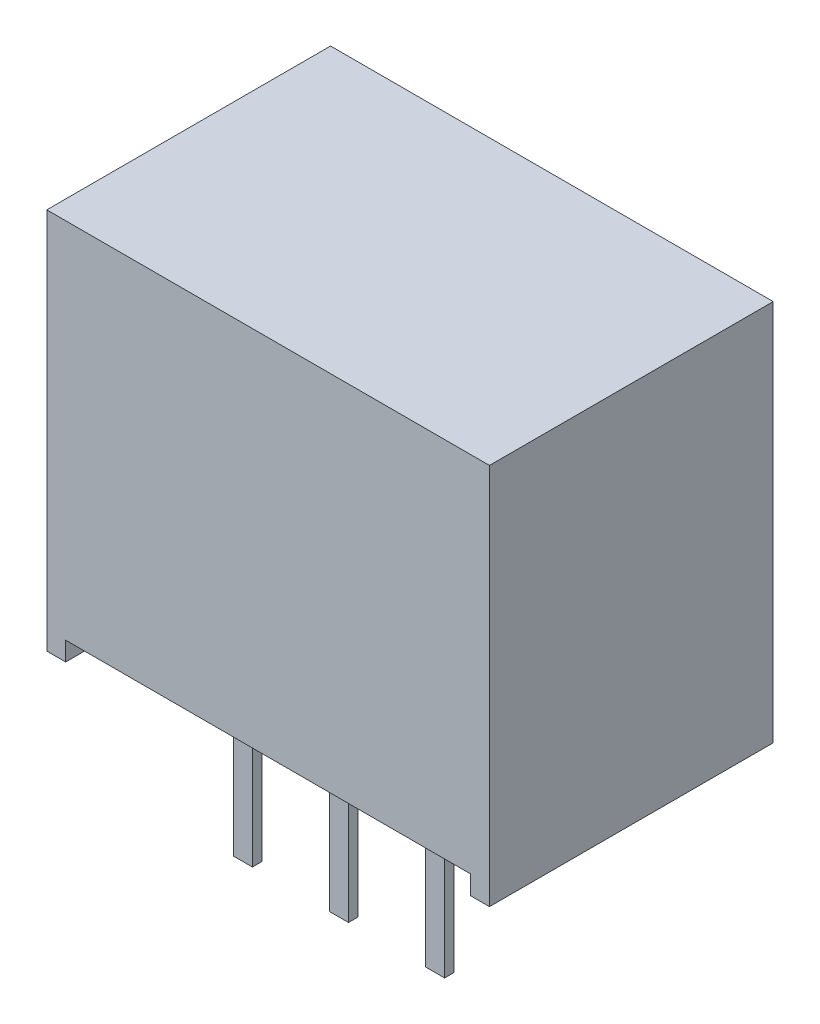
ISO-10303-21;
HEADER;
FILE_DESCRIPTION(('STEP AP214'),'2;1');
FILE_NAME('part.step','',(''),(''),'','','');
FILE_SCHEMA(('AUTOMOTIVE_DESIGN { 1 0 10303 214 1 1 1 1 }'));
ENDSEC;
DATA;
#1=APPLICATION_CONTEXT('core data for automotive mechanical design processes');
#2=APPLICATION_PROTOCOL_DEFINITION('international standard','automotive_design',2000,#1);
#3=PRODUCT_CONTEXT('',#1,'mechanical');
#4=PRODUCT('Part','Part','',(#3));
#5=PRODUCT_RELATED_PRODUCT_CATEGORY('part','',(#4));
#6=PRODUCT_DEFINITION_FORMATION('','',#4);
#7=PRODUCT_DEFINITION_CONTEXT('part definition',#1,'design');
#8=PRODUCT_DEFINITION('design','',#6,#7);
#9=PRODUCT_DEFINITION_SHAPE('','',#8);
#10=(LENGTH_UNIT() NAMED_UNIT(*) SI_UNIT(.MILLI.,.METRE.));
#11=(NAMED_UNIT(*) PLANE_ANGLE_UNIT() SI_UNIT($,.RADIAN.));
#12=(NAMED_UNIT(*) SI_UNIT($,.STERADIAN.) SOLID_ANGLE_UNIT());
#13=UNCERTAINTY_MEASURE_WITH_UNIT(LENGTH_MEASURE(1.E-05),#10,'distance_accuracy_value','');
#14=(GEOMETRIC_REPRESENTATION_CONTEXT(3) GLOBAL_UNCERTAINTY_ASSIGNED_CONTEXT((#13)) GLOBAL_UNIT_ASSIGNED_CONTEXT((#10,
#11,#12)) REPRESENTATION_CONTEXT('',''));
#15=CARTESIAN_POINT('',(0.,0.,0.));
#16=DIRECTION('',(0.,0.,1.));
#17=DIRECTION('',(1.,0.,0.));
#18=AXIS2_PLACEMENT_3D('',#15,#16,#17);
#19=CARTESIAN_POINT('',(2.29,-9.4,1.625));
#20=DIRECTION('',(0.,-1.,0.));
#21=DIRECTION('',(0.,0.,-1.));
#22=AXIS2_PLACEMENT_3D('',#19,#20,#21);
#23=PLANE('',#22);
#24=DIRECTION('',(0.,0.,-1.));
#25=VECTOR('',#24,1.);
#26=CARTESIAN_POINT('',(2.29,-9.4,1.875));
#27=LINE('',#26,#25);
#28=CARTESIAN_POINT('',(2.29,-9.4,1.875));
#29=VERTEX_POINT('',#28);
#30=CARTESIAN_POINT('',(2.29,-9.4,1.625));
#31=VERTEX_POINT('',#30);
#32=EDGE_CURVE('E197',#29,#31,#27,.T.);
#33=ORIENTED_EDGE('',*,*,#32,.T.);
#34=DIRECTION('',(1.,0.,0.));
#35=VECTOR('',#34,1.);
#36=CARTESIAN_POINT('',(2.29,-9.4,1.625));
#37=LINE('',#36,#35);
#38=CARTESIAN_POINT('',(2.79,-9.4,1.625));
#39=VERTEX_POINT('',#38);
#40=EDGE_CURVE('E194',#31,#39,#37,.T.);
#41=ORIENTED_EDGE('',*,*,#40,.T.);
#42=DIRECTION('',(0.,0.,1.));
#43=VECTOR('',#42,1.);
#44=CARTESIAN_POINT('',(2.79,-9.4,1.875));
#45=LINE('',#44,#43);
#46=CARTESIAN_POINT('',(2.79,-9.4,1.875));
#47=VERTEX_POINT('',#46);
#48=EDGE_CURVE('E26',#39,#47,#45,.T.);
#49=ORIENTED_EDGE('',*,*,#48,.T.);
#50=DIRECTION('',(-1.,0.,0.));
#51=VECTOR('',#50,1.);
#52=CARTESIAN_POINT('',(2.29,-9.4,1.875));
#53=LINE('',#52,#51);
#54=EDGE_CURVE('E10',#47,#29,#53,.T.);
#55=ORIENTED_EDGE('',*,*,#54,.T.);
#56=EDGE_LOOP('',(#33,#41,#49,#55));
#57=FACE_BOUND('',#56,.T.);
#58=ADVANCED_FACE('F15',(#57),#23,.T.);
#59=CARTESIAN_POINT('',(2.29,-9.4,1.875));
#60=DIRECTION('',(0.,0.,-1.));
#61=DIRECTION('',(0.,-1.,0.));
#62=AXIS2_PLACEMENT_3D('',#59,#60,#61);
#63=PLANE('',#62);
#64=DIRECTION('',(-1.,0.,0.));
#65=VECTOR('',#64,1.);
#66=CARTESIAN_POINT('',(2.29,-4.8,1.875));
#67=LINE('',#66,#65);
#68=CARTESIAN_POINT('',(2.79,-4.8,1.875));
#69=VERTEX_POINT('',#68);
#70=CARTESIAN_POINT('',(2.29,-4.8,1.875));
#71=VERTEX_POINT('',#70);
#72=EDGE_CURVE('E213',#69,#71,#67,.T.);
#73=ORIENTED_EDGE('',*,*,#72,.T.);
#74=DIRECTION('',(0.,1.,0.));
#75=VECTOR('',#74,1.);
#76=CARTESIAN_POINT('',(2.29,-9.4,1.875));
#77=LINE('',#76,#75);
#78=EDGE_CURVE('E178',#29,#71,#77,.T.);
#79=ORIENTED_EDGE('',*,*,#78,.F.);
#80=ORIENTED_EDGE('',*,*,#54,.F.);
#81=DIRECTION('',(0.,1.,0.));
#82=VECTOR('',#81,1.);
#83=CARTESIAN_POINT('',(2.79,-9.4,1.875));
#84=LINE('',#83,#82);
#85=EDGE_CURVE('E290',#47,#69,#84,.T.);
#86=ORIENTED_EDGE('',*,*,#85,.T.);
#87=EDGE_LOOP('',(#73,#79,#80,#86));
#88=FACE_BOUND('',#87,.T.);
#89=ADVANCED_FACE('F707',(#88),#63,.F.);
#90=CARTESIAN_POINT('',(2.79,-9.4,1.875));
#91=DIRECTION('',(-1.,0.,0.));
#92=DIRECTION('',(0.,0.,1.));
#93=AXIS2_PLACEMENT_3D('',#90,#91,#92);
#94=PLANE('',#93);
#95=DIRECTION('',(0.,0.,1.));
#96=VECTOR('',#95,1.);
#97=CARTESIAN_POINT('',(2.79,-4.8,1.875));
#98=LINE('',#97,#96);
#99=CARTESIAN_POINT('',(2.79,-4.8,1.625));
#100=VERTEX_POINT('',#99);
#101=EDGE_CURVE('E207',#100,#69,#98,.T.);
#102=ORIENTED_EDGE('',*,*,#101,.T.);
#103=ORIENTED_EDGE('',*,*,#85,.F.);
#104=ORIENTED_EDGE('',*,*,#48,.F.);
#105=DIRECTION('',(0.,1.,0.));
#106=VECTOR('',#105,1.);
#107=CARTESIAN_POINT('',(2.79,-9.4,1.625));
#108=LINE('',#107,#106);
#109=EDGE_CURVE('E283',#39,#100,#108,.T.);
#110=ORIENTED_EDGE('',*,*,#109,.T.);
#111=EDGE_LOOP('',(#102,#103,#104,#110));
#112=FACE_BOUND('',#111,.T.);
#113=ADVANCED_FACE('F768',(#112),#94,.F.);
#114=CARTESIAN_POINT('',(2.29,-9.4,1.625));
#115=DIRECTION('',(0.,0.,1.));
#116=DIRECTION('',(1.,0.,0.));
#117=AXIS2_PLACEMENT_3D('',#114,#115,#116);
#118=PLANE('',#117);
#119=DIRECTION('',(1.,0.,0.));
#120=VECTOR('',#119,1.);
#121=CARTESIAN_POINT('',(2.29,-4.8,1.625));
#122=LINE('',#121,#120);
#123=CARTESIAN_POINT('',(2.29,-4.8,1.625));
#124=VERTEX_POINT('',#123);
#125=EDGE_CURVE('E191',#124,#100,#122,.T.);
#126=ORIENTED_EDGE('',*,*,#125,.T.);
#127=ORIENTED_EDGE('',*,*,#109,.F.);
#128=ORIENTED_EDGE('',*,*,#40,.F.);
#129=DIRECTION('',(0.,1.,0.));
#130=VECTOR('',#129,1.);
#131=CARTESIAN_POINT('',(2.29,-9.4,1.625));
#132=LINE('',#131,#130);
#133=EDGE_CURVE('E187',#31,#124,#132,.T.);
#134=ORIENTED_EDGE('',*,*,#133,.T.);
#135=EDGE_LOOP('',(#126,#127,#128,#134));
#136=FACE_BOUND('',#135,.T.);
#137=ADVANCED_FACE('F189',(#136),#118,.F.);
#138=CARTESIAN_POINT('',(2.29,-9.4,1.875));
#139=DIRECTION('',(1.,0.,0.));
#140=DIRECTION('',(0.,0.,1.));
#141=AXIS2_PLACEMENT_3D('',#138,#139,#140);
#142=PLANE('',#141);
#143=DIRECTION('',(0.,0.,-1.));
#144=VECTOR('',#143,1.);
#145=CARTESIAN_POINT('',(2.29,-4.8,1.875));
#146=LINE('',#145,#144);
#147=EDGE_CURVE('E205',#71,#124,#146,.T.);
#148=ORIENTED_EDGE('',*,*,#147,.T.);
#149=ORIENTED_EDGE('',*,*,#133,.F.);
#150=ORIENTED_EDGE('',*,*,#32,.F.);
#151=ORIENTED_EDGE('',*,*,#78,.T.);
#152=EDGE_LOOP('',(#148,#149,#150,#151));
#153=FACE_BOUND('',#152,.T.);
#154=ADVANCED_FACE('F211',(#153),#142,.F.);
#155=CARTESIAN_POINT('',(-0.25,-9.4,1.625));
#156=DIRECTION('',(0.,-1.,0.));
#157=DIRECTION('',(0.,0.,-1.));
#158=AXIS2_PLACEMENT_3D('',#155,#156,#157);
#159=PLANE('',#158);
#160=DIRECTION('',(0.,0.,-1.));
#161=VECTOR('',#160,1.);
#162=CARTESIAN_POINT('',(-0.25,-9.4,1.875));
#163=LINE('',#162,#161);
#164=CARTESIAN_POINT('',(-0.25,-9.4,1.875));
#165=VERTEX_POINT('',#164);
#166=CARTESIAN_POINT('',(-0.25,-9.4,1.625));
#167=VERTEX_POINT('',#166);
#168=EDGE_CURVE('E239',#165,#167,#163,.T.);
#169=ORIENTED_EDGE('',*,*,#168,.T.);
#170=DIRECTION('',(1.,0.,0.));
#171=VECTOR('',#170,1.);
#172=CARTESIAN_POINT('',(-0.25,-9.4,1.625));
#173=LINE('',#172,#171);
#174=CARTESIAN_POINT('',(0.25,-9.4,1.625));
#175=VERTEX_POINT('',#174);
#176=EDGE_CURVE('E246',#167,#175,#173,.T.);
#177=ORIENTED_EDGE('',*,*,#176,.T.);
#178=DIRECTION('',(0.,0.,1.));
#179=VECTOR('',#178,1.);
#180=CARTESIAN_POINT('',(0.25,-9.4,1.875));
#181=LINE('',#180,#179);
#182=CARTESIAN_POINT('',(0.25,-9.4,1.875));
#183=VERTEX_POINT('',#182);
#184=EDGE_CURVE('E322',#175,#183,#181,.T.);
#185=ORIENTED_EDGE('',*,*,#184,.T.);
#186=DIRECTION('',(-1.,0.,0.));
#187=VECTOR('',#186,1.);
#188=CARTESIAN_POINT('',(-0.25,-9.4,1.875));
#189=LINE('',#188,#187);
#190=EDGE_CURVE('E198',#183,#165,#189,.T.);
#191=ORIENTED_EDGE('',*,*,#190,.T.);
#192=EDGE_LOOP('',(#169,#177,#185,#191));
#193=FACE_BOUND('',#192,.T.);
#194=ADVANCED_FACE('F694',(#193),#159,.T.);
#195=CARTESIAN_POINT('',(-0.25,-9.4,1.875));
#196=DIRECTION('',(0.,0.,-1.));
#197=DIRECTION('',(0.,-1.,0.));
#198=AXIS2_PLACEMENT_3D('',#195,#196,#197);
#199=PLANE('',#198);
#200=DIRECTION('',(-1.,0.,0.));
#201=VECTOR('',#200,1.);
#202=CARTESIAN_POINT('',(-0.25,-4.8,1.875));
#203=LINE('',#202,#201);
#204=CARTESIAN_POINT('',(0.25,-4.8,1.875));
#205=VERTEX_POINT('',#204);
#206=CARTESIAN_POINT('',(-0.25,-4.8,1.875));
#207=VERTEX_POINT('',#206);
#208=EDGE_CURVE('E312',#205,#207,#203,.T.);
#209=ORIENTED_EDGE('',*,*,#208,.T.);
#210=DIRECTION('',(0.,1.,0.));
#211=VECTOR('',#210,1.);
#212=CARTESIAN_POINT('',(-0.25,-9.4,1.875));
#213=LINE('',#212,#211);
#214=EDGE_CURVE('E235',#165,#207,#213,.T.);
#215=ORIENTED_EDGE('',*,*,#214,.F.);
#216=ORIENTED_EDGE('',*,*,#190,.F.);
#217=DIRECTION('',(0.,1.,0.));
#218=VECTOR('',#217,1.);
#219=CARTESIAN_POINT('',(0.25,-9.4,1.875));
#220=LINE('',#219,#218);
#221=EDGE_CURVE('E249',#183,#205,#220,.T.);
#222=ORIENTED_EDGE('',*,*,#221,.T.);
#223=EDGE_LOOP('',(#209,#215,#216,#222));
#224=FACE_BOUND('',#223,.T.);
#225=ADVANCED_FACE('F682',(#224),#199,.F.);
#226=CARTESIAN_POINT('',(0.25,-9.4,1.875));
#227=DIRECTION('',(-1.,0.,0.));
#228=DIRECTION('',(0.,0.,1.));
#229=AXIS2_PLACEMENT_3D('',#226,#227,#228);
#230=PLANE('',#229);
#231=DIRECTION('',(0.,0.,1.));
#232=VECTOR('',#231,1.);
#233=CARTESIAN_POINT('',(0.25,-4.8,1.875));
#234=LINE('',#233,#232);
#235=CARTESIAN_POINT('',(0.25,-4.8,1.625));
#236=VERTEX_POINT('',#235);
#237=EDGE_CURVE('E320',#236,#205,#234,.T.);
#238=ORIENTED_EDGE('',*,*,#237,.T.);
#239=ORIENTED_EDGE('',*,*,#221,.F.);
#240=ORIENTED_EDGE('',*,*,#184,.F.);
#241=DIRECTION('',(0.,1.,0.));
#242=VECTOR('',#241,1.);
#243=CARTESIAN_POINT('',(0.25,-9.4,1.625));
#244=LINE('',#243,#242);
#245=EDGE_CURVE('E238',#175,#236,#244,.T.);
#246=ORIENTED_EDGE('',*,*,#245,.T.);
#247=EDGE_LOOP('',(#238,#239,#240,#246));
#248=FACE_BOUND('',#247,.T.);
#249=ADVANCED_FACE('F670',(#248),#230,.F.);
#250=CARTESIAN_POINT('',(-0.25,-9.4,1.625));
#251=DIRECTION('',(0.,0.,1.));
#252=DIRECTION('',(1.,0.,0.));
#253=AXIS2_PLACEMENT_3D('',#250,#251,#252);
#254=PLANE('',#253);
#255=DIRECTION('',(1.,0.,0.));
#256=VECTOR('',#255,1.);
#257=CARTESIAN_POINT('',(-0.25,-4.8,1.625));
#258=LINE('',#257,#256);
#259=CARTESIAN_POINT('',(-0.25,-4.8,1.625));
#260=VERTEX_POINT('',#259);
#261=EDGE_CURVE('E315',#260,#236,#258,.T.);
#262=ORIENTED_EDGE('',*,*,#261,.T.);
#263=ORIENTED_EDGE('',*,*,#245,.F.);
#264=ORIENTED_EDGE('',*,*,#176,.F.);
#265=DIRECTION('',(0.,1.,0.));
#266=VECTOR('',#265,1.);
#267=CARTESIAN_POINT('',(-0.25,-9.4,1.625));
#268=LINE('',#267,#266);
#269=EDGE_CURVE('E368',#167,#260,#268,.T.);
#270=ORIENTED_EDGE('',*,*,#269,.T.);
#271=EDGE_LOOP('',(#262,#263,#264,#270));
#272=FACE_BOUND('',#271,.T.);
#273=ADVANCED_FACE('F643',(#272),#254,.F.);
#274=CARTESIAN_POINT('',(-0.25,-9.4,1.875));
#275=DIRECTION('',(1.,0.,0.));
#276=DIRECTION('',(0.,0.,1.));
#277=AXIS2_PLACEMENT_3D('',#274,#275,#276);
#278=PLANE('',#277);
#279=DIRECTION('',(0.,0.,-1.));
#280=VECTOR('',#279,1.);
#281=CARTESIAN_POINT('',(-0.25,-4.8,1.875));
#282=LINE('',#281,#280);
#283=EDGE_CURVE('E304',#207,#260,#282,.T.);
#284=ORIENTED_EDGE('',*,*,#283,.T.);
#285=ORIENTED_EDGE('',*,*,#269,.F.);
#286=ORIENTED_EDGE('',*,*,#168,.F.);
#287=ORIENTED_EDGE('',*,*,#214,.T.);
#288=EDGE_LOOP('',(#284,#285,#286,#287));
#289=FACE_BOUND('',#288,.T.);
#290=ADVANCED_FACE('F638',(#289),#278,.F.);
#291=CARTESIAN_POINT('',(-2.79,-9.4,1.625));
#292=DIRECTION('',(0.,-1.,0.));
#293=DIRECTION('',(0.,0.,-1.));
#294=AXIS2_PLACEMENT_3D('',#291,#292,#293);
#295=PLANE('',#294);
#296=DIRECTION('',(0.,0.,-1.));
#297=VECTOR('',#296,1.);
#298=CARTESIAN_POINT('',(-2.79,-9.4,1.875));
#299=LINE('',#298,#297);
#300=CARTESIAN_POINT('',(-2.79,-9.4,1.875));
#301=VERTEX_POINT('',#300);
#302=CARTESIAN_POINT('',(-2.79,-9.4,1.625));
#303=VERTEX_POINT('',#302);
#304=EDGE_CURVE('E361',#301,#303,#299,.T.);
#305=ORIENTED_EDGE('',*,*,#304,.T.);
#306=DIRECTION('',(1.,0.,0.));
#307=VECTOR('',#306,1.);
#308=CARTESIAN_POINT('',(-2.79,-9.4,1.625));
#309=LINE('',#308,#307);
#310=CARTESIAN_POINT('',(-2.29,-9.4,1.625));
#311=VERTEX_POINT('',#310);
#312=EDGE_CURVE('E229',#303,#311,#309,.T.);
#313=ORIENTED_EDGE('',*,*,#312,.T.);
#314=DIRECTION('',(0.,0.,1.));
#315=VECTOR('',#314,1.);
#316=CARTESIAN_POINT('',(-2.29,-9.4,1.875));
#317=LINE('',#316,#315);
#318=CARTESIAN_POINT('',(-2.29,-9.4,1.875));
#319=VERTEX_POINT('',#318);
#320=EDGE_CURVE('E19',#311,#319,#317,.T.);
#321=ORIENTED_EDGE('',*,*,#320,.T.);
#322=DIRECTION('',(-1.,0.,0.));
#323=VECTOR('',#322,1.);
#324=CARTESIAN_POINT('',(-2.79,-9.4,1.875));
#325=LINE('',#324,#323);
#326=EDGE_CURVE('E391',#319,#301,#325,.T.);
#327=ORIENTED_EDGE('',*,*,#326,.T.);
#328=EDGE_LOOP('',(#305,#313,#321,#327));
#329=FACE_BOUND('',#328,.T.);
#330=ADVANCED_FACE('F446',(#329),#295,.T.);
#331=CARTESIAN_POINT('',(-2.79,-9.4,1.875));
#332=DIRECTION('',(0.,0.,-1.));
#333=DIRECTION('',(0.,-1.,0.));
#334=AXIS2_PLACEMENT_3D('',#331,#332,#333);
#335=PLANE('',#334);
#336=DIRECTION('',(-1.,0.,0.));
#337=VECTOR('',#336,1.);
#338=CARTESIAN_POINT('',(-2.79,-4.8,1.875));
#339=LINE('',#338,#337);
#340=CARTESIAN_POINT('',(-2.29,-4.8,1.875));
#341=VERTEX_POINT('',#340);
#342=CARTESIAN_POINT('',(-2.79,-4.8,1.875));
#343=VERTEX_POINT('',#342);
#344=EDGE_CURVE('E277',#341,#343,#339,.T.);
#345=ORIENTED_EDGE('',*,*,#344,.T.);
#346=DIRECTION('',(0.,1.,0.));
#347=VECTOR('',#346,1.);
#348=CARTESIAN_POINT('',(-2.79,-9.4,1.875));
#349=LINE('',#348,#347);
#350=EDGE_CURVE('E308',#301,#343,#349,.T.);
#351=ORIENTED_EDGE('',*,*,#350,.F.);
#352=ORIENTED_EDGE('',*,*,#326,.F.);
#353=DIRECTION('',(0.,1.,0.));
#354=VECTOR('',#353,1.);
#355=CARTESIAN_POINT('',(-2.29,-9.4,1.875));
#356=LINE('',#355,#354);
#357=EDGE_CURVE('E233',#319,#341,#356,.T.);
#358=ORIENTED_EDGE('',*,*,#357,.T.);
#359=EDGE_LOOP('',(#345,#351,#352,#358));
#360=FACE_BOUND('',#359,.T.);
#361=ADVANCED_FACE('F622',(#360),#335,.F.);
#362=CARTESIAN_POINT('',(-2.29,-9.4,1.875));
#363=DIRECTION('',(-1.,0.,0.));
#364=DIRECTION('',(0.,0.,1.));
#365=AXIS2_PLACEMENT_3D('',#362,#363,#364);
#366=PLANE('',#365);
#367=DIRECTION('',(0.,0.,1.));
#368=VECTOR('',#367,1.);
#369=CARTESIAN_POINT('',(-2.29,-4.8,1.875));
#370=LINE('',#369,#368);
#371=CARTESIAN_POINT('',(-2.29,-4.8,1.625));
#372=VERTEX_POINT('',#371);
#373=EDGE_CURVE('E223',#372,#341,#370,.T.);
#374=ORIENTED_EDGE('',*,*,#373,.T.);
#375=ORIENTED_EDGE('',*,*,#357,.F.);
#376=ORIENTED_EDGE('',*,*,#320,.F.);
#377=DIRECTION('',(0.,1.,0.));
#378=VECTOR('',#377,1.);
#379=CARTESIAN_POINT('',(-2.29,-9.4,1.625));
#380=LINE('',#379,#378);
#381=EDGE_CURVE('E234',#311,#372,#380,.T.);
#382=ORIENTED_EDGE('',*,*,#381,.T.);
#383=EDGE_LOOP('',(#374,#375,#376,#382));
#384=FACE_BOUND('',#383,.T.);
#385=ADVANCED_FACE('F627',(#384),#366,.F.);
#386=CARTESIAN_POINT('',(-2.79,-9.4,1.625));
#387=DIRECTION('',(0.,0.,1.));
#388=DIRECTION('',(1.,0.,0.));
#389=AXIS2_PLACEMENT_3D('',#386,#387,#388);
#390=PLANE('',#389);
#391=DIRECTION('',(1.,0.,0.));
#392=VECTOR('',#391,1.);
#393=CARTESIAN_POINT('',(-2.79,-4.8,1.625));
#394=LINE('',#393,#392);
#395=CARTESIAN_POINT('',(-2.79,-4.8,1.625));
#396=VERTEX_POINT('',#395);
#397=EDGE_CURVE('E214',#396,#372,#394,.T.);
#398=ORIENTED_EDGE('',*,*,#397,.T.);
#399=ORIENTED_EDGE('',*,*,#381,.F.);
#400=ORIENTED_EDGE('',*,*,#312,.F.);
#401=DIRECTION('',(0.,1.,0.));
#402=VECTOR('',#401,1.);
#403=CARTESIAN_POINT('',(-2.79,-9.4,1.625));
#404=LINE('',#403,#402);
#405=EDGE_CURVE('E281',#303,#396,#404,.T.);
#406=ORIENTED_EDGE('',*,*,#405,.T.);
#407=EDGE_LOOP('',(#398,#399,#400,#406));
#408=FACE_BOUND('',#407,.T.);
#409=ADVANCED_FACE('F440',(#408),#390,.F.);
#410=CARTESIAN_POINT('',(-2.79,-9.4,1.875));
#411=DIRECTION('',(1.,0.,0.));
#412=DIRECTION('',(0.,0.,1.));
#413=AXIS2_PLACEMENT_3D('',#410,#411,#412);
#414=PLANE('',#413);
#415=DIRECTION('',(0.,0.,-1.));
#416=VECTOR('',#415,1.);
#417=CARTESIAN_POINT('',(-2.79,-4.8,1.875));
#418=LINE('',#417,#416);
#419=EDGE_CURVE('E319',#343,#396,#418,.T.);
#420=ORIENTED_EDGE('',*,*,#419,.T.);
#421=ORIENTED_EDGE('',*,*,#405,.F.);
#422=ORIENTED_EDGE('',*,*,#304,.F.);
#423=ORIENTED_EDGE('',*,*,#350,.T.);
#424=EDGE_LOOP('',(#420,#421,#422,#423));
#425=FACE_BOUND('',#424,.T.);
#426=ADVANCED_FACE('F429',(#425),#414,.F.);
#427=CARTESIAN_POINT('',(5.35,-5.3,3.75));
#428=DIRECTION('',(0.,1.,0.));
#429=DIRECTION('',(1.,0.,0.));
#430=AXIS2_PLACEMENT_3D('',#427,#428,#429);
#431=PLANE('',#430);
#432=DIRECTION('',(0.,0.,-1.));
#433=VECTOR('',#432,1.);
#434=CARTESIAN_POINT('',(5.35,-5.3,-3.75));
#435=LINE('',#434,#433);
#436=CARTESIAN_POINT('',(5.35,-5.3,3.75));
#437=VERTEX_POINT('',#436);
#438=CARTESIAN_POINT('',(5.35,-5.3,-3.75));
#439=VERTEX_POINT('',#438);
#440=EDGE_CURVE('E278',#437,#439,#435,.T.);
#441=ORIENTED_EDGE('',*,*,#440,.T.);
#442=DIRECTION('',(1.,0.,0.));
#443=VECTOR('',#442,1.);
#444=CARTESIAN_POINT('',(5.85,-5.3,-3.75));
#445=LINE('',#444,#443);
#446=CARTESIAN_POINT('',(5.85,-5.3,-3.75));
#447=VERTEX_POINT('',#446);
#448=EDGE_CURVE('E250',#439,#447,#445,.T.);
#449=ORIENTED_EDGE('',*,*,#448,.T.);
#450=DIRECTION('',(0.,0.,1.));
#451=VECTOR('',#450,1.);
#452=CARTESIAN_POINT('',(5.85,-5.3,3.75));
#453=LINE('',#452,#451);
#454=CARTESIAN_POINT('',(5.85,-5.3,3.75));
#455=VERTEX_POINT('',#454);
#456=EDGE_CURVE('E378',#447,#455,#453,.T.);
#457=ORIENTED_EDGE('',*,*,#456,.T.);
#458=DIRECTION('',(-1.,0.,0.));
#459=VECTOR('',#458,1.);
#460=CARTESIAN_POINT('',(5.35,-5.3,3.75));
#461=LINE('',#460,#459);
#462=EDGE_CURVE('E253',#455,#437,#461,.T.);
#463=ORIENTED_EDGE('',*,*,#462,.T.);
#464=EDGE_LOOP('',(#441,#449,#457,#463));
#465=FACE_BOUND('',#464,.T.);
#466=ADVANCED_FACE('F787',(#465),#431,.F.);
#467=CARTESIAN_POINT('',(5.35,-5.3,-3.75));
#468=DIRECTION('',(1.,0.,0.));
#469=DIRECTION('',(0.,1.,0.));
#470=AXIS2_PLACEMENT_3D('',#467,#468,#469);
#471=PLANE('',#470);
#472=DIRECTION('',(0.,0.,-1.));
#473=VECTOR('',#472,1.);
#474=CARTESIAN_POINT('',(5.35,-4.8,-3.75));
#475=LINE('',#474,#473);
#476=CARTESIAN_POINT('',(5.35,-4.8,3.75));
#477=VERTEX_POINT('',#476);
#478=CARTESIAN_POINT('',(5.35,-4.8,-3.75));
#479=VERTEX_POINT('',#478);
#480=EDGE_CURVE('E332',#477,#479,#475,.T.);
#481=ORIENTED_EDGE('',*,*,#480,.T.);
#482=DIRECTION('',(0.,1.,0.));
#483=VECTOR('',#482,1.);
#484=CARTESIAN_POINT('',(5.35,-5.3,-3.75));
#485=LINE('',#484,#483);
#486=EDGE_CURVE('E252',#439,#479,#485,.T.);
#487=ORIENTED_EDGE('',*,*,#486,.F.);
#488=ORIENTED_EDGE('',*,*,#440,.F.);
#489=DIRECTION('',(0.,1.,0.));
#490=VECTOR('',#489,1.);
#491=CARTESIAN_POINT('',(5.35,-5.3,3.75));
#492=LINE('',#491,#490);
#493=EDGE_CURVE('E264',#437,#477,#492,.T.);
#494=ORIENTED_EDGE('',*,*,#493,.T.);
#495=EDGE_LOOP('',(#481,#487,#488,#494));
#496=FACE_BOUND('',#495,.T.);
#497=ADVANCED_FACE('F792',(#496),#471,.F.);
#498=CARTESIAN_POINT('',(-5.85,-5.3,3.75));
#499=DIRECTION('',(0.,-1.,0.));
#500=DIRECTION('',(0.,0.,-1.));
#501=AXIS2_PLACEMENT_3D('',#498,#499,#500);
#502=PLANE('',#501);
#503=DIRECTION('',(-1.,0.,0.));
#504=VECTOR('',#503,1.);
#505=CARTESIAN_POINT('',(-5.35,-5.3,3.75));
#506=LINE('',#505,#504);
#507=CARTESIAN_POINT('',(-5.35,-5.3,3.75));
#508=VERTEX_POINT('',#507);
#509=CARTESIAN_POINT('',(-5.85,-5.3,3.75));
#510=VERTEX_POINT('',#509);
#511=EDGE_CURVE('E331',#508,#510,#506,.T.);
#512=ORIENTED_EDGE('',*,*,#511,.T.);
#513=DIRECTION('',(0.,0.,-1.));
#514=VECTOR('',#513,1.);
#515=CARTESIAN_POINT('',(-5.85,-5.3,3.75));
#516=LINE('',#515,#514);
#517=CARTESIAN_POINT('',(-5.85,-5.3,-3.75));
#518=VERTEX_POINT('',#517);
#519=EDGE_CURVE('E324',#510,#518,#516,.T.);
#520=ORIENTED_EDGE('',*,*,#519,.T.);
#521=DIRECTION('',(1.,0.,0.));
#522=VECTOR('',#521,1.);
#523=CARTESIAN_POINT('',(-5.85,-5.3,-3.75));
#524=LINE('',#523,#522);
#525=CARTESIAN_POINT('',(-5.35,-5.3,-3.75));
#526=VERTEX_POINT('',#525);
#527=EDGE_CURVE('E240',#518,#526,#524,.T.);
#528=ORIENTED_EDGE('',*,*,#527,.T.);
#529=DIRECTION('',(0.,0.,1.));
#530=VECTOR('',#529,1.);
#531=CARTESIAN_POINT('',(-5.35,-5.3,-3.75));
#532=LINE('',#531,#530);
#533=EDGE_CURVE('E244',#526,#508,#532,.T.);
#534=ORIENTED_EDGE('',*,*,#533,.T.);
#535=EDGE_LOOP('',(#512,#520,#528,#534));
#536=FACE_BOUND('',#535,.T.);
#537=ADVANCED_FACE('F17',(#536),#502,.T.);
#538=CARTESIAN_POINT('',(-5.35,-5.3,-3.75));
#539=DIRECTION('',(-1.,0.,0.));
#540=DIRECTION('',(0.,0.,1.));
#541=AXIS2_PLACEMENT_3D('',#538,#539,#540);
#542=PLANE('',#541);
#543=DIRECTION('',(0.,0.,1.));
#544=VECTOR('',#543,1.);
#545=CARTESIAN_POINT('',(-5.35,-4.8,-3.75));
#546=LINE('',#545,#544);
#547=CARTESIAN_POINT('',(-5.35,-4.8,-3.75));
#548=VERTEX_POINT('',#547);
#549=CARTESIAN_POINT('',(-5.35,-4.8,3.75));
#550=VERTEX_POINT('',#549);
#551=EDGE_CURVE('E305',#548,#550,#546,.T.);
#552=ORIENTED_EDGE('',*,*,#551,.T.);
#553=DIRECTION('',(0.,1.,0.));
#554=VECTOR('',#553,1.);
#555=CARTESIAN_POINT('',(-5.35,-5.3,3.75));
#556=LINE('',#555,#554);
#557=EDGE_CURVE('E270',#508,#550,#556,.T.);
#558=ORIENTED_EDGE('',*,*,#557,.F.);
#559=ORIENTED_EDGE('',*,*,#533,.F.);
#560=DIRECTION('',(0.,1.,0.));
#561=VECTOR('',#560,1.);
#562=CARTESIAN_POINT('',(-5.35,-5.3,-3.75));
#563=LINE('',#562,#561);
#564=EDGE_CURVE('E245',#526,#548,#563,.T.);
#565=ORIENTED_EDGE('',*,*,#564,.T.);
#566=EDGE_LOOP('',(#552,#558,#559,#565));
#567=FACE_BOUND('',#566,.T.);
#568=ADVANCED_FACE('F751',(#567),#542,.F.);
#569=CARTESIAN_POINT('',(-5.85,-4.8,-3.75));
#570=DIRECTION('',(0.,0.,1.));
#571=DIRECTION('',(1.,0.,0.));
#572=AXIS2_PLACEMENT_3D('',#569,#570,#571);
#573=PLANE('',#572);
#574=DIRECTION('',(0.,-1.,0.));
#575=VECTOR('',#574,1.);
#576=CARTESIAN_POINT('',(-5.85,4.8,-3.75));
#577=LINE('',#576,#575);
#578=CARTESIAN_POINT('',(-5.85,4.8,-3.75));
#579=VERTEX_POINT('',#578);
#580=EDGE_CURVE('E209',#579,#518,#577,.T.);
#581=ORIENTED_EDGE('',*,*,#580,.F.);
#582=DIRECTION('',(-1.,0.,0.));
#583=VECTOR('',#582,1.);
#584=CARTESIAN_POINT('',(-5.85,4.8,-3.75));
#585=LINE('',#584,#583);
#586=CARTESIAN_POINT('',(5.85,4.8,-3.75));
#587=VERTEX_POINT('',#586);
#588=EDGE_CURVE('E374',#587,#579,#585,.T.);
#589=ORIENTED_EDGE('',*,*,#588,.F.);
#590=DIRECTION('',(0.,1.,0.));
#591=VECTOR('',#590,1.);
#592=CARTESIAN_POINT('',(5.85,4.8,-3.75));
#593=LINE('',#592,#591);
#594=EDGE_CURVE('E347',#447,#587,#593,.T.);
#595=ORIENTED_EDGE('',*,*,#594,.F.);
#596=ORIENTED_EDGE('',*,*,#448,.F.);
#597=ORIENTED_EDGE('',*,*,#486,.T.);
#598=DIRECTION('',(1.,0.,0.));
#599=VECTOR('',#598,1.);
#600=CARTESIAN_POINT('',(-5.85,-4.8,-3.75));
#601=LINE('',#600,#599);
#602=EDGE_CURVE('E300',#548,#479,#601,.T.);
#603=ORIENTED_EDGE('',*,*,#602,.F.);
#604=ORIENTED_EDGE('',*,*,#564,.F.);
#605=ORIENTED_EDGE('',*,*,#527,.F.);
#606=EDGE_LOOP('',(#581,#589,#595,#596,#597,#603,#604,#605));
#607=FACE_BOUND('',#606,.T.);
#608=ADVANCED_FACE('F461',(#607),#573,.F.);
#609=CARTESIAN_POINT('',(-5.85,-4.8,3.75));
#610=DIRECTION('',(0.,0.,1.));
#611=DIRECTION('',(1.,0.,0.));
#612=AXIS2_PLACEMENT_3D('',#609,#610,#611);
#613=PLANE('',#612);
#614=DIRECTION('',(0.,-1.,0.));
#615=VECTOR('',#614,1.);
#616=CARTESIAN_POINT('',(-5.85,4.8,3.75));
#617=LINE('',#616,#615);
#618=CARTESIAN_POINT('',(-5.85,4.8,3.75));
#619=VERTEX_POINT('',#618);
#620=EDGE_CURVE('E328',#619,#510,#617,.T.);
#621=ORIENTED_EDGE('',*,*,#620,.T.);
#622=ORIENTED_EDGE('',*,*,#511,.F.);
#623=ORIENTED_EDGE('',*,*,#557,.T.);
#624=DIRECTION('',(1.,0.,0.));
#625=VECTOR('',#624,1.);
#626=CARTESIAN_POINT('',(-5.85,-4.8,3.75));
#627=LINE('',#626,#625);
#628=EDGE_CURVE('E335',#550,#477,#627,.T.);
#629=ORIENTED_EDGE('',*,*,#628,.T.);
#630=ORIENTED_EDGE('',*,*,#493,.F.);
#631=ORIENTED_EDGE('',*,*,#462,.F.);
#632=DIRECTION('',(0.,1.,0.));
#633=VECTOR('',#632,1.);
#634=CARTESIAN_POINT('',(5.85,4.8,3.75));
#635=LINE('',#634,#633);
#636=CARTESIAN_POINT('',(5.85,4.8,3.75));
#637=VERTEX_POINT('',#636);
#638=EDGE_CURVE('E227',#455,#637,#635,.T.);
#639=ORIENTED_EDGE('',*,*,#638,.T.);
#640=DIRECTION('',(-1.,0.,0.));
#641=VECTOR('',#640,1.);
#642=CARTESIAN_POINT('',(-5.85,4.8,3.75));
#643=LINE('',#642,#641);
#644=EDGE_CURVE('E377',#637,#619,#643,.T.);
#645=ORIENTED_EDGE('',*,*,#644,.T.);
#646=EDGE_LOOP('',(#621,#622,#623,#629,#630,#631,#639,#645));
#647=FACE_BOUND('',#646,.T.);
#648=ADVANCED_FACE('F738',(#647),#613,.T.);
#649=CARTESIAN_POINT('',(-5.85,4.8,3.75));
#650=DIRECTION('',(0.,-1.,0.));
#651=DIRECTION('',(0.,0.,-1.));
#652=AXIS2_PLACEMENT_3D('',#649,#650,#651);
#653=PLANE('',#652);
#654=ORIENTED_EDGE('',*,*,#588,.T.);
#655=DIRECTION('',(0.,0.,-1.));
#656=VECTOR('',#655,1.);
#657=CARTESIAN_POINT('',(-5.85,4.8,3.75));
#658=LINE('',#657,#656);
#659=EDGE_CURVE('E338',#619,#579,#658,.T.);
#660=ORIENTED_EDGE('',*,*,#659,.F.);
#661=ORIENTED_EDGE('',*,*,#644,.F.);
#662=DIRECTION('',(0.,0.,-1.));
#663=VECTOR('',#662,1.);
#664=CARTESIAN_POINT('',(5.85,4.8,3.75));
#665=LINE('',#664,#663);
#666=EDGE_CURVE('E357',#637,#587,#665,.T.);
#667=ORIENTED_EDGE('',*,*,#666,.T.);
#668=EDGE_LOOP('',(#654,#660,#661,#667));
#669=FACE_BOUND('',#668,.T.);
#670=ADVANCED_FACE('F457',(#669),#653,.F.);
#671=CARTESIAN_POINT('',(5.85,4.8,3.75));
#672=DIRECTION('',(-1.,0.,0.));
#673=DIRECTION('',(0.,1.,0.));
#674=AXIS2_PLACEMENT_3D('',#671,#672,#673);
#675=PLANE('',#674);
#676=ORIENTED_EDGE('',*,*,#594,.T.);
#677=ORIENTED_EDGE('',*,*,#666,.F.);
#678=ORIENTED_EDGE('',*,*,#638,.F.);
#679=ORIENTED_EDGE('',*,*,#456,.F.);
#680=EDGE_LOOP('',(#676,#677,#678,#679));
#681=FACE_BOUND('',#680,.T.);
#682=ADVANCED_FACE('F657',(#681),#675,.F.);
#683=CARTESIAN_POINT('',(-5.85,4.8,3.75));
#684=DIRECTION('',(1.,0.,0.));
#685=DIRECTION('',(0.,1.,0.));
#686=AXIS2_PLACEMENT_3D('',#683,#684,#685);
#687=PLANE('',#686);
#688=ORIENTED_EDGE('',*,*,#580,.T.);
#689=ORIENTED_EDGE('',*,*,#519,.F.);
#690=ORIENTED_EDGE('',*,*,#620,.F.);
#691=ORIENTED_EDGE('',*,*,#659,.T.);
#692=EDGE_LOOP('',(#688,#689,#690,#691));
#693=FACE_BOUND('',#692,.T.);
#694=ADVANCED_FACE('F652',(#693),#687,.F.);
#695=CARTESIAN_POINT('',(-5.85,-4.8,3.75));
#696=DIRECTION('',(0.,1.,0.));
#697=DIRECTION('',(1.,0.,0.));
#698=AXIS2_PLACEMENT_3D('',#695,#696,#697);
#699=PLANE('',#698);
#700=ORIENTED_EDGE('',*,*,#147,.F.);
#701=ORIENTED_EDGE('',*,*,#72,.F.);
#702=ORIENTED_EDGE('',*,*,#101,.F.);
#703=ORIENTED_EDGE('',*,*,#125,.F.);
#704=EDGE_LOOP('',(#700,#701,#702,#703));
#705=FACE_BOUND('',#704,.T.);
#706=ORIENTED_EDGE('',*,*,#419,.F.);
#707=ORIENTED_EDGE('',*,*,#344,.F.);
#708=ORIENTED_EDGE('',*,*,#373,.F.);
#709=ORIENTED_EDGE('',*,*,#397,.F.);
#710=EDGE_LOOP('',(#706,#707,#708,#709));
#711=FACE_BOUND('',#710,.T.);
#712=ORIENTED_EDGE('',*,*,#283,.F.);
#713=ORIENTED_EDGE('',*,*,#208,.F.);
#714=ORIENTED_EDGE('',*,*,#237,.F.);
#715=ORIENTED_EDGE('',*,*,#261,.F.);
#716=EDGE_LOOP('',(#712,#713,#714,#715));
#717=FACE_BOUND('',#716,.T.);
#718=ORIENTED_EDGE('',*,*,#480,.F.);
#719=ORIENTED_EDGE('',*,*,#628,.F.);
#720=ORIENTED_EDGE('',*,*,#551,.F.);
#721=ORIENTED_EDGE('',*,*,#602,.T.);
#722=EDGE_LOOP('',(#718,#719,#720,#721));
#723=FACE_BOUND('',#722,.T.);
#724=ADVANCED_FACE('F202',(#705,#711,#717,#723),#699,.F.);
#725=CLOSED_SHELL('',(#58,#89,#113,#137,#154,#194,#225,#249,#273,#290,#330,#361,#385,#409,#426,
#466,#497,#537,#568,#608,#648,#670,#682,#694,#724));
#726=MANIFOLD_SOLID_BREP('B1',#725);
#727=ADVANCED_BREP_SHAPE_REPRESENTATION('',(#18,#726),#14);
#728=SHAPE_DEFINITION_REPRESENTATION(#9,#727);
ENDSEC;
END-ISO-10303-21;
